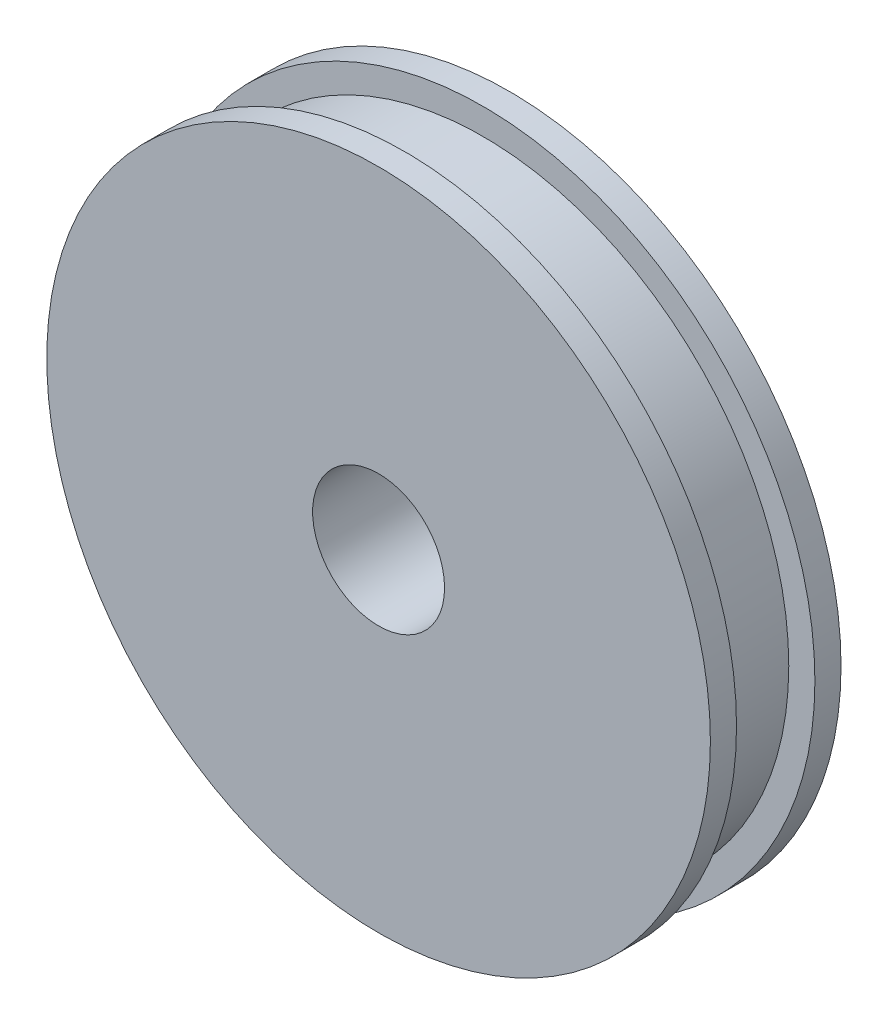
ISO-10303-21;
HEADER;
FILE_DESCRIPTION(('STEP AP214'),'2;1');
FILE_NAME('part.step','',(''),(''),'','','');
FILE_SCHEMA(('AUTOMOTIVE_DESIGN { 1 0 10303 214 1 1 1 1 }'));
ENDSEC;
DATA;
#1=APPLICATION_CONTEXT('core data for automotive mechanical design processes');
#2=APPLICATION_PROTOCOL_DEFINITION('international standard','automotive_design',2000,#1);
#3=PRODUCT_CONTEXT('',#1,'mechanical');
#4=PRODUCT('Part','Part','',(#3));
#5=PRODUCT_RELATED_PRODUCT_CATEGORY('part','',(#4));
#6=PRODUCT_DEFINITION_FORMATION('','',#4);
#7=PRODUCT_DEFINITION_CONTEXT('part definition',#1,'design');
#8=PRODUCT_DEFINITION('design','',#6,#7);
#9=PRODUCT_DEFINITION_SHAPE('','',#8);
#10=(LENGTH_UNIT() NAMED_UNIT(*) SI_UNIT(.MILLI.,.METRE.));
#11=(NAMED_UNIT(*) PLANE_ANGLE_UNIT() SI_UNIT($,.RADIAN.));
#12=(NAMED_UNIT(*) SI_UNIT($,.STERADIAN.) SOLID_ANGLE_UNIT());
#13=UNCERTAINTY_MEASURE_WITH_UNIT(LENGTH_MEASURE(1.E-05),#10,'distance_accuracy_value','');
#14=(GEOMETRIC_REPRESENTATION_CONTEXT(3) GLOBAL_UNCERTAINTY_ASSIGNED_CONTEXT((#13)) GLOBAL_UNIT_ASSIGNED_CONTEXT((#10,
#11,#12)) REPRESENTATION_CONTEXT('',''));
#15=CARTESIAN_POINT('',(0.,0.,0.));
#16=DIRECTION('',(0.,0.,1.));
#17=DIRECTION('',(1.,0.,0.));
#18=AXIS2_PLACEMENT_3D('',#15,#16,#17);
#19=CARTESIAN_POINT('',(0.,0.,10.));
#20=DIRECTION('',(0.,0.,-1.));
#21=DIRECTION('',(-1.,0.,0.));
#22=AXIS2_PLACEMENT_3D('',#19,#20,#21);
#23=CYLINDRICAL_SURFACE('',#22,25.4);
#24=CARTESIAN_POINT('',(0.,0.,0.));
#25=DIRECTION('',(0.,0.,1.));
#26=DIRECTION('',(1.,0.,0.));
#27=AXIS2_PLACEMENT_3D('',#24,#25,#26);
#28=CIRCLE('',#27,25.4);
#29=CARTESIAN_POINT('',(25.4,0.,0.));
#30=VERTEX_POINT('',#29);
#31=EDGE_CURVE('E36',#30,#30,#28,.T.);
#32=ORIENTED_EDGE('',*,*,#31,.T.);
#33=EDGE_LOOP('',(#32));
#34=FACE_BOUND('',#33,.T.);
#35=CARTESIAN_POINT('',(0.,0.,2.));
#36=DIRECTION('',(0.,0.,1.));
#37=DIRECTION('',(1.,0.,0.));
#38=AXIS2_PLACEMENT_3D('',#35,#36,#37);
#39=CIRCLE('',#38,25.4);
#40=CARTESIAN_POINT('',(25.4,0.,2.));
#41=VERTEX_POINT('',#40);
#42=EDGE_CURVE('E59',#41,#41,#39,.T.);
#43=ORIENTED_EDGE('',*,*,#42,.F.);
#44=EDGE_LOOP('',(#43));
#45=FACE_BOUND('',#44,.T.);
#46=ADVANCED_FACE('F33',(#34,#45),#23,.T.);
#47=CARTESIAN_POINT('',(0.,0.,10.));
#48=DIRECTION('',(0.,0.,1.));
#49=DIRECTION('',(1.,0.,0.));
#50=AXIS2_PLACEMENT_3D('',#47,#48,#49);
#51=CIRCLE('',#50,25.4);
#52=CARTESIAN_POINT('',(25.4,0.,10.));
#53=VERTEX_POINT('',#52);
#54=EDGE_CURVE('E10',#53,#53,#51,.T.);
#55=ORIENTED_EDGE('',*,*,#54,.F.);
#56=EDGE_LOOP('',(#55));
#57=FACE_BOUND('',#56,.T.);
#58=CARTESIAN_POINT('',(0.,0.,8.));
#59=DIRECTION('',(0.,0.,1.));
#60=DIRECTION('',(1.,0.,0.));
#61=AXIS2_PLACEMENT_3D('',#58,#59,#60);
#62=CIRCLE('',#61,25.4);
#63=CARTESIAN_POINT('',(25.4,0.,8.));
#64=VERTEX_POINT('',#63);
#65=EDGE_CURVE('E56',#64,#64,#62,.T.);
#66=ORIENTED_EDGE('',*,*,#65,.T.);
#67=EDGE_LOOP('',(#66));
#68=FACE_BOUND('',#67,.T.);
#69=ADVANCED_FACE('F67',(#57,#68),#23,.T.);
#70=CARTESIAN_POINT('',(0.,0.,10.));
#71=DIRECTION('',(0.,0.,1.));
#72=DIRECTION('',(1.,0.,0.));
#73=AXIS2_PLACEMENT_3D('',#70,#71,#72);
#74=PLANE('',#73);
#75=ORIENTED_EDGE('',*,*,#54,.T.);
#76=EDGE_LOOP('',(#75));
#77=FACE_BOUND('',#76,.T.);
#78=CARTESIAN_POINT('',(0.,0.,10.));
#79=DIRECTION('',(0.,0.,1.));
#80=DIRECTION('',(1.,0.,0.));
#81=AXIS2_PLACEMENT_3D('',#78,#79,#80);
#82=CIRCLE('',#81,5.05);
#83=CARTESIAN_POINT('',(5.05,0.,10.));
#84=VERTEX_POINT('',#83);
#85=EDGE_CURVE('E43',#84,#84,#82,.T.);
#86=ORIENTED_EDGE('',*,*,#85,.F.);
#87=EDGE_LOOP('',(#86));
#88=FACE_BOUND('',#87,.T.);
#89=ADVANCED_FACE('F72',(#77,#88),#74,.T.);
#90=CARTESIAN_POINT('',(0.,0.,0.));
#91=DIRECTION('',(0.,0.,1.));
#92=DIRECTION('',(1.,0.,0.));
#93=AXIS2_PLACEMENT_3D('',#90,#91,#92);
#94=PLANE('',#93);
#95=ORIENTED_EDGE('',*,*,#31,.F.);
#96=EDGE_LOOP('',(#95));
#97=FACE_BOUND('',#96,.T.);
#98=CARTESIAN_POINT('',(0.,0.,0.));
#99=DIRECTION('',(0.,0.,1.));
#100=DIRECTION('',(1.,0.,0.));
#101=AXIS2_PLACEMENT_3D('',#98,#99,#100);
#102=CIRCLE('',#101,5.05);
#103=CARTESIAN_POINT('',(5.05,0.,0.));
#104=VERTEX_POINT('',#103);
#105=EDGE_CURVE('E45',#104,#104,#102,.T.);
#106=ORIENTED_EDGE('',*,*,#105,.T.);
#107=EDGE_LOOP('',(#106));
#108=FACE_BOUND('',#107,.T.);
#109=ADVANCED_FACE('F76',(#97,#108),#94,.F.);
#110=CARTESIAN_POINT('',(0.,0.,10.));
#111=DIRECTION('',(0.,0.,-1.));
#112=DIRECTION('',(-1.,0.,0.));
#113=AXIS2_PLACEMENT_3D('',#110,#111,#112);
#114=CYLINDRICAL_SURFACE('',#113,5.05);
#115=ORIENTED_EDGE('',*,*,#85,.T.);
#116=EDGE_LOOP('',(#115));
#117=FACE_BOUND('',#116,.T.);
#118=ORIENTED_EDGE('',*,*,#105,.F.);
#119=EDGE_LOOP('',(#118));
#120=FACE_BOUND('',#119,.T.);
#121=ADVANCED_FACE('F79',(#117,#120),#114,.F.);
#122=CARTESIAN_POINT('',(0.,25.4,2.));
#123=DIRECTION('',(0.,0.,1.));
#124=DIRECTION('',(1.,0.,0.));
#125=AXIS2_PLACEMENT_3D('',#122,#123,#124);
#126=PLANE('',#125);
#127=ORIENTED_EDGE('',*,*,#42,.T.);
#128=EDGE_LOOP('',(#127));
#129=FACE_BOUND('',#128,.T.);
#130=CARTESIAN_POINT('',(0.,0.,2.));
#131=DIRECTION('',(0.,0.,1.));
#132=DIRECTION('',(1.,0.,0.));
#133=AXIS2_PLACEMENT_3D('',#130,#131,#132);
#134=CIRCLE('',#133,23.4);
#135=CARTESIAN_POINT('',(23.4,0.,2.));
#136=VERTEX_POINT('',#135);
#137=EDGE_CURVE('E48',#136,#136,#134,.T.);
#138=ORIENTED_EDGE('',*,*,#137,.F.);
#139=EDGE_LOOP('',(#138));
#140=FACE_BOUND('',#139,.T.);
#141=ADVANCED_FACE('F63',(#129,#140),#126,.T.);
#142=CARTESIAN_POINT('',(0.,0.,10.));
#143=DIRECTION('',(0.,0.,1.));
#144=DIRECTION('',(1.,0.,0.));
#145=AXIS2_PLACEMENT_3D('',#142,#143,#144);
#146=CYLINDRICAL_SURFACE('',#145,23.4);
#147=ORIENTED_EDGE('',*,*,#137,.T.);
#148=EDGE_LOOP('',(#147));
#149=FACE_BOUND('',#148,.T.);
#150=CARTESIAN_POINT('',(0.,0.,8.));
#151=DIRECTION('',(0.,0.,1.));
#152=DIRECTION('',(1.,0.,0.));
#153=AXIS2_PLACEMENT_3D('',#150,#151,#152);
#154=CIRCLE('',#153,23.4);
#155=CARTESIAN_POINT('',(23.4,0.,8.));
#156=VERTEX_POINT('',#155);
#157=EDGE_CURVE('E53',#156,#156,#154,.T.);
#158=ORIENTED_EDGE('',*,*,#157,.F.);
#159=EDGE_LOOP('',(#158));
#160=FACE_BOUND('',#159,.T.);
#161=ADVANCED_FACE('F88',(#149,#160),#146,.T.);
#162=CARTESIAN_POINT('',(0.,25.4,8.));
#163=DIRECTION('',(0.,0.,-1.));
#164=DIRECTION('',(-1.,0.,0.));
#165=AXIS2_PLACEMENT_3D('',#162,#163,#164);
#166=PLANE('',#165);
#167=ORIENTED_EDGE('',*,*,#157,.T.);
#168=EDGE_LOOP('',(#167));
#169=FACE_BOUND('',#168,.T.);
#170=ORIENTED_EDGE('',*,*,#65,.F.);
#171=EDGE_LOOP('',(#170));
#172=FACE_BOUND('',#171,.T.);
#173=ADVANCED_FACE('F130',(#169,#172),#166,.T.);
#174=CLOSED_SHELL('',(#46,#69,#89,#109,#121,#141,#161,#173));
#175=MANIFOLD_SOLID_BREP('B2',#174);
#176=ADVANCED_BREP_SHAPE_REPRESENTATION('',(#18,#175),#14);
#177=SHAPE_DEFINITION_REPRESENTATION(#9,#176);
ENDSEC;
END-ISO-10303-21;
